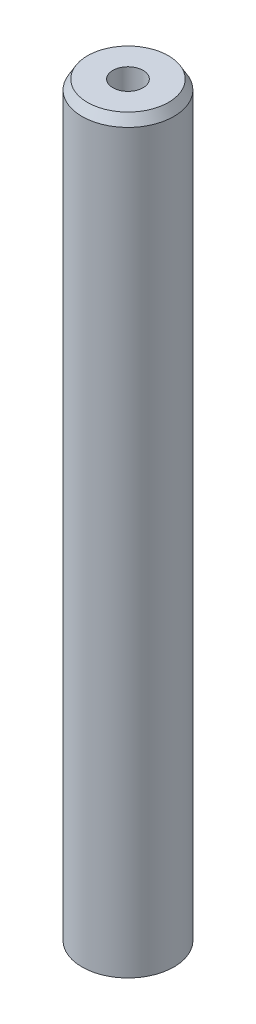
ISO-10303-21;
HEADER;
FILE_DESCRIPTION(('STEP AP214'),'2;1');
FILE_NAME('part.step','',(''),(''),'','','');
FILE_SCHEMA(('AUTOMOTIVE_DESIGN { 1 0 10303 214 1 1 1 1 }'));
ENDSEC;
DATA;
#1=APPLICATION_CONTEXT('core data for automotive mechanical design processes');
#2=APPLICATION_PROTOCOL_DEFINITION('international standard','automotive_design',2000,#1);
#3=PRODUCT_CONTEXT('',#1,'mechanical');
#4=PRODUCT('Part','Part','',(#3));
#5=PRODUCT_RELATED_PRODUCT_CATEGORY('part','',(#4));
#6=PRODUCT_DEFINITION_FORMATION('','',#4);
#7=PRODUCT_DEFINITION_CONTEXT('part definition',#1,'design');
#8=PRODUCT_DEFINITION('design','',#6,#7);
#9=PRODUCT_DEFINITION_SHAPE('','',#8);
#10=(LENGTH_UNIT() NAMED_UNIT(*) SI_UNIT(.MILLI.,.METRE.));
#11=(NAMED_UNIT(*) PLANE_ANGLE_UNIT() SI_UNIT($,.RADIAN.));
#12=(NAMED_UNIT(*) SI_UNIT($,.STERADIAN.) SOLID_ANGLE_UNIT());
#13=UNCERTAINTY_MEASURE_WITH_UNIT(LENGTH_MEASURE(1.E-05),#10,'distance_accuracy_value','');
#14=(GEOMETRIC_REPRESENTATION_CONTEXT(3) GLOBAL_UNCERTAINTY_ASSIGNED_CONTEXT((#13)) GLOBAL_UNIT_ASSIGNED_CONTEXT((#10,
#11,#12)) REPRESENTATION_CONTEXT('',''));
#15=CARTESIAN_POINT('',(0.,0.,0.));
#16=DIRECTION('',(0.,0.,1.));
#17=DIRECTION('',(1.,0.,0.));
#18=AXIS2_PLACEMENT_3D('',#15,#16,#17);
#19=CARTESIAN_POINT('',(0.,368.093118582441,0.));
#20=DIRECTION('',(0.,-1.,0.));
#21=DIRECTION('',(0.,0.,-1.));
#22=AXIS2_PLACEMENT_3D('',#19,#20,#21);
#23=CYLINDRICAL_SURFACE('',#22,22.5);
#24=CARTESIAN_POINT('',(0.,363.471593739179,0.));
#25=DIRECTION('',(0.,1.,0.));
#26=DIRECTION('',(0.,0.,1.));
#27=AXIS2_PLACEMENT_3D('',#24,#25,#26);
#28=CIRCLE('',#27,22.5);
#29=CARTESIAN_POINT('',(0.,363.471593739179,22.5));
#30=VERTEX_POINT('',#29);
#31=EDGE_CURVE('E50',#30,#30,#28,.F.);
#32=ORIENTED_EDGE('',*,*,#31,.T.);
#33=EDGE_LOOP('',(#32));
#34=FACE_BOUND('',#33,.T.);
#35=CARTESIAN_POINT('',(0.,2.66823861232374,0.));
#36=DIRECTION('',(0.,1.,0.));
#37=DIRECTION('',(0.,0.,1.));
#38=AXIS2_PLACEMENT_3D('',#35,#36,#37);
#39=CIRCLE('',#38,22.5);
#40=CARTESIAN_POINT('',(0.,2.66823861232374,22.5));
#41=VERTEX_POINT('',#40);
#42=EDGE_CURVE('E51',#41,#41,#39,.T.);
#43=ORIENTED_EDGE('',*,*,#42,.T.);
#44=EDGE_LOOP('',(#43));
#45=FACE_BOUND('',#44,.T.);
#46=ADVANCED_FACE('F39',(#34,#45),#23,.T.);
#47=CARTESIAN_POINT('',(0.,368.093118582441,0.));
#48=DIRECTION('',(0.,1.,0.));
#49=DIRECTION('',(0.,0.,1.));
#50=AXIS2_PLACEMENT_3D('',#47,#48,#49);
#51=PLANE('',#50);
#52=CARTESIAN_POINT('',(0.,368.093118582441,0.));
#53=DIRECTION('',(0.,1.,0.));
#54=DIRECTION('',(0.,0.,1.));
#55=AXIS2_PLACEMENT_3D('',#52,#53,#54);
#56=CIRCLE('',#55,19.8317613876763);
#57=CARTESIAN_POINT('',(0.,368.093118582441,19.8317613876763));
#58=VERTEX_POINT('',#57);
#59=EDGE_CURVE('E54',#58,#58,#56,.T.);
#60=ORIENTED_EDGE('',*,*,#59,.T.);
#61=EDGE_LOOP('',(#60));
#62=FACE_BOUND('',#61,.T.);
#63=CARTESIAN_POINT('',(0.,368.093118582441,0.));
#64=DIRECTION('',(0.,1.,0.));
#65=DIRECTION('',(0.,0.,1.));
#66=AXIS2_PLACEMENT_3D('',#63,#64,#65);
#67=CIRCLE('',#66,7.40338605698551);
#68=CARTESIAN_POINT('',(0.,368.093118582441,7.40338605698551));
#69=VERTEX_POINT('',#68);
#70=EDGE_CURVE('E58',#69,#69,#67,.T.);
#71=ORIENTED_EDGE('',*,*,#70,.F.);
#72=EDGE_LOOP('',(#71));
#73=FACE_BOUND('',#72,.T.);
#74=ADVANCED_FACE('F69',(#62,#73),#51,.T.);
#75=CARTESIAN_POINT('',(0.,0.,0.));
#76=DIRECTION('',(0.,1.,0.));
#77=DIRECTION('',(0.,0.,1.));
#78=AXIS2_PLACEMENT_3D('',#75,#76,#77);
#79=PLANE('',#78);
#80=CARTESIAN_POINT('',(0.,0.,0.));
#81=DIRECTION('',(0.,1.,0.));
#82=DIRECTION('',(0.,0.,1.));
#83=AXIS2_PLACEMENT_3D('',#80,#81,#82);
#84=CIRCLE('',#83,17.8784751567382);
#85=CARTESIAN_POINT('',(0.,0.,17.8784751567382));
#86=VERTEX_POINT('',#85);
#87=EDGE_CURVE('E10',#86,#86,#84,.F.);
#88=ORIENTED_EDGE('',*,*,#87,.T.);
#89=EDGE_LOOP('',(#88));
#90=FACE_BOUND('',#89,.T.);
#91=CARTESIAN_POINT('',(0.,0.,0.));
#92=DIRECTION('',(0.,1.,0.));
#93=DIRECTION('',(0.,0.,1.));
#94=AXIS2_PLACEMENT_3D('',#91,#92,#93);
#95=CIRCLE('',#94,7.40338605698551);
#96=CARTESIAN_POINT('',(0.,0.,7.40338605698551));
#97=VERTEX_POINT('',#96);
#98=EDGE_CURVE('E63',#97,#97,#95,.T.);
#99=ORIENTED_EDGE('',*,*,#98,.T.);
#100=EDGE_LOOP('',(#99));
#101=FACE_BOUND('',#100,.T.);
#102=ADVANCED_FACE('F75',(#90,#101),#79,.F.);
#103=CARTESIAN_POINT('',(0.,368.093118582441,0.));
#104=DIRECTION('',(0.,-1.,0.));
#105=DIRECTION('',(0.,0.,-1.));
#106=AXIS2_PLACEMENT_3D('',#103,#104,#105);
#107=CYLINDRICAL_SURFACE('',#106,7.40338605698551);
#108=ORIENTED_EDGE('',*,*,#70,.T.);
#109=EDGE_LOOP('',(#108));
#110=FACE_BOUND('',#109,.T.);
#111=ORIENTED_EDGE('',*,*,#98,.F.);
#112=EDGE_LOOP('',(#111));
#113=FACE_BOUND('',#112,.T.);
#114=ADVANCED_FACE('F70',(#110,#113),#107,.F.);
#115=CARTESIAN_POINT('',(0.,368.093118582441,0.));
#116=DIRECTION('',(0.,-1.,0.));
#117=DIRECTION('',(0.,0.,-1.));
#118=AXIS2_PLACEMENT_3D('',#115,#116,#117);
#119=CONICAL_SURFACE('',#118,19.8317613876763,0.523598775598297);
#120=ORIENTED_EDGE('',*,*,#31,.F.);
#121=EDGE_LOOP('',(#120));
#122=FACE_BOUND('',#121,.T.);
#123=ORIENTED_EDGE('',*,*,#59,.F.);
#124=EDGE_LOOP('',(#123));
#125=FACE_BOUND('',#124,.T.);
#126=ADVANCED_FACE('F81',(#122,#125),#119,.T.);
#127=CARTESIAN_POINT('',(0.,2.66823861232374,0.));
#128=DIRECTION('',(0.,1.,0.));
#129=DIRECTION('',(0.,0.,1.));
#130=AXIS2_PLACEMENT_3D('',#127,#128,#129);
#131=CONICAL_SURFACE('',#130,22.5,1.0471975511966);
#132=ORIENTED_EDGE('',*,*,#87,.F.);
#133=EDGE_LOOP('',(#132));
#134=FACE_BOUND('',#133,.T.);
#135=ORIENTED_EDGE('',*,*,#42,.F.);
#136=EDGE_LOOP('',(#135));
#137=FACE_BOUND('',#136,.T.);
#138=ADVANCED_FACE('F45',(#134,#137),#131,.T.);
#139=CLOSED_SHELL('',(#46,#74,#102,#114,#126,#138));
#140=MANIFOLD_SOLID_BREP('B2',#139);
#141=ADVANCED_BREP_SHAPE_REPRESENTATION('',(#18,#140),#14);
#142=SHAPE_DEFINITION_REPRESENTATION(#9,#141);
ENDSEC;
END-ISO-10303-21;
